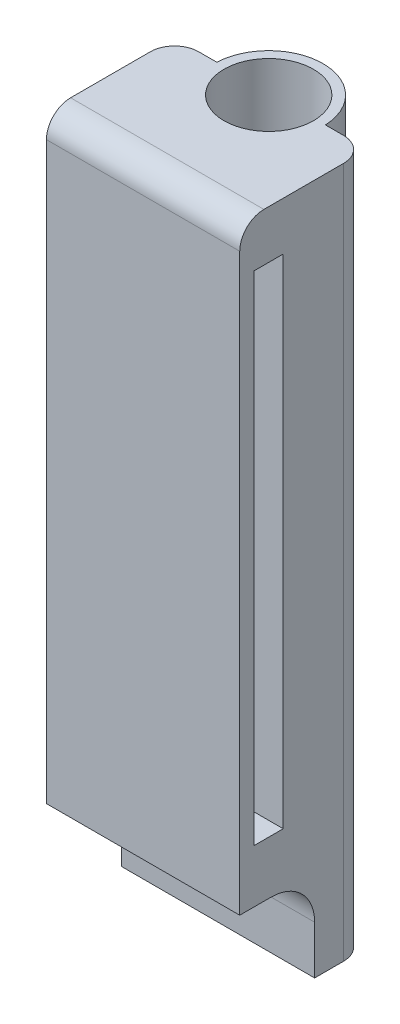
ISO-10303-21;
HEADER;
FILE_DESCRIPTION(('STEP AP214'),'2;1');
FILE_NAME('part.step','',(''),(''),'','','');
FILE_SCHEMA(('AUTOMOTIVE_DESIGN { 1 0 10303 214 1 1 1 1 }'));
ENDSEC;
DATA;
#1=APPLICATION_CONTEXT('core data for automotive mechanical design processes');
#2=APPLICATION_PROTOCOL_DEFINITION('international standard','automotive_design',2000,#1);
#3=PRODUCT_CONTEXT('',#1,'mechanical');
#4=PRODUCT('Part','Part','',(#3));
#5=PRODUCT_RELATED_PRODUCT_CATEGORY('part','',(#4));
#6=PRODUCT_DEFINITION_FORMATION('','',#4);
#7=PRODUCT_DEFINITION_CONTEXT('part definition',#1,'design');
#8=PRODUCT_DEFINITION('design','',#6,#7);
#9=PRODUCT_DEFINITION_SHAPE('','',#8);
#10=(LENGTH_UNIT() NAMED_UNIT(*) SI_UNIT(.MILLI.,.METRE.));
#11=(NAMED_UNIT(*) PLANE_ANGLE_UNIT() SI_UNIT($,.RADIAN.));
#12=(NAMED_UNIT(*) SI_UNIT($,.STERADIAN.) SOLID_ANGLE_UNIT());
#13=UNCERTAINTY_MEASURE_WITH_UNIT(LENGTH_MEASURE(1.E-05),#10,'distance_accuracy_value','');
#14=(GEOMETRIC_REPRESENTATION_CONTEXT(3) GLOBAL_UNCERTAINTY_ASSIGNED_CONTEXT((#13)) GLOBAL_UNIT_ASSIGNED_CONTEXT((#10,
#11,#12)) REPRESENTATION_CONTEXT('',''));
#15=CARTESIAN_POINT('',(0.,0.,0.));
#16=DIRECTION('',(0.,0.,1.));
#17=DIRECTION('',(1.,0.,0.));
#18=AXIS2_PLACEMENT_3D('',#15,#16,#17);
#19=CARTESIAN_POINT('',(0.,143.,0.));
#20=DIRECTION('',(0.,1.,0.));
#21=DIRECTION('',(0.,0.,1.));
#22=AXIS2_PLACEMENT_3D('',#19,#20,#21);
#23=PLANE('',#22);
#24=DIRECTION('',(0.,0.,1.));
#25=VECTOR('',#24,1.);
#26=CARTESIAN_POINT('',(-20.,143.,-0.499999999999993));
#27=LINE('',#26,#25);
#28=CARTESIAN_POINT('',(-20.,143.,4.50000000000001));
#29=VERTEX_POINT('',#28);
#30=CARTESIAN_POINT('',(-20.,143.,21.));
#31=VERTEX_POINT('',#30);
#32=EDGE_CURVE('E188',#29,#31,#27,.T.);
#33=ORIENTED_EDGE('',*,*,#32,.T.);
#34=DIRECTION('',(1.,0.,0.));
#35=VECTOR('',#34,1.);
#36=CARTESIAN_POINT('',(20.,143.,21.));
#37=LINE('',#36,#35);
#38=CARTESIAN_POINT('',(20.,143.,21.));
#39=VERTEX_POINT('',#38);
#40=EDGE_CURVE('E232',#31,#39,#37,.T.);
#41=ORIENTED_EDGE('',*,*,#40,.T.);
#42=DIRECTION('',(0.,0.,-1.));
#43=VECTOR('',#42,1.);
#44=CARTESIAN_POINT('',(20.,143.,26.));
#45=LINE('',#44,#43);
#46=CARTESIAN_POINT('',(20.,143.,4.50000000000001));
#47=VERTEX_POINT('',#46);
#48=EDGE_CURVE('E198',#39,#47,#45,.T.);
#49=ORIENTED_EDGE('',*,*,#48,.T.);
#50=CARTESIAN_POINT('',(15.,143.,4.50000000000001));
#51=DIRECTION('',(0.,1.,0.));
#52=DIRECTION('',(0.,0.,1.));
#53=AXIS2_PLACEMENT_3D('',#50,#51,#52);
#54=CIRCLE('',#53,5.);
#55=CARTESIAN_POINT('',(15.,143.,-0.499999999999993));
#56=VERTEX_POINT('',#55);
#57=EDGE_CURVE('E218',#47,#56,#54,.T.);
#58=ORIENTED_EDGE('',*,*,#57,.T.);
#59=DIRECTION('',(-1.,0.,0.));
#60=VECTOR('',#59,1.);
#61=CARTESIAN_POINT('',(20.,143.,-0.499999999999993));
#62=LINE('',#61,#60);
#63=CARTESIAN_POINT('',(11.2388833964945,143.,-0.499999999999992));
#64=VERTEX_POINT('',#63);
#65=EDGE_CURVE('E252',#56,#64,#62,.T.);
#66=ORIENTED_EDGE('',*,*,#65,.T.);
#67=CARTESIAN_POINT('',(0.,143.,0.));
#68=DIRECTION('',(0.,1.,0.));
#69=DIRECTION('',(0.,0.,1.));
#70=AXIS2_PLACEMENT_3D('',#67,#68,#69);
#71=CIRCLE('',#70,11.25);
#72=CARTESIAN_POINT('',(-11.2388833964945,143.,-0.499999999999993));
#73=VERTEX_POINT('',#72);
#74=EDGE_CURVE('E251',#64,#73,#71,.T.);
#75=ORIENTED_EDGE('',*,*,#74,.T.);
#76=DIRECTION('',(-1.,0.,0.));
#77=VECTOR('',#76,1.);
#78=CARTESIAN_POINT('',(-17.,143.,-0.499999999999993));
#79=LINE('',#78,#77);
#80=CARTESIAN_POINT('',(-15.,143.,-0.499999999999993));
#81=VERTEX_POINT('',#80);
#82=EDGE_CURVE('E250',#73,#81,#79,.T.);
#83=ORIENTED_EDGE('',*,*,#82,.T.);
#84=CARTESIAN_POINT('',(-15.,143.,4.50000000000001));
#85=DIRECTION('',(0.,1.,0.));
#86=DIRECTION('',(0.,0.,1.));
#87=AXIS2_PLACEMENT_3D('',#84,#85,#86);
#88=CIRCLE('',#87,5.);
#89=EDGE_CURVE('E220',#81,#29,#88,.T.);
#90=ORIENTED_EDGE('',*,*,#89,.T.);
#91=EDGE_LOOP('',(#33,#41,#49,#58,#66,#75,#83,#90));
#92=FACE_BOUND('',#91,.T.);
#93=CARTESIAN_POINT('',(0.,143.,0.));
#94=DIRECTION('',(0.,1.,0.));
#95=DIRECTION('',(0.,0.,1.));
#96=AXIS2_PLACEMENT_3D('',#93,#94,#95);
#97=CIRCLE('',#96,9.25);
#98=CARTESIAN_POINT('',(0.,143.,9.25));
#99=VERTEX_POINT('',#98);
#100=EDGE_CURVE('E180',#99,#99,#97,.T.);
#101=ORIENTED_EDGE('',*,*,#100,.F.);
#102=EDGE_LOOP('',(#101));
#103=FACE_BOUND('',#102,.T.);
#104=ADVANCED_FACE('F37',(#92,#103),#23,.T.);
#105=CARTESIAN_POINT('',(0.,0.,0.));
#106=DIRECTION('',(0.,1.,0.));
#107=DIRECTION('',(0.,0.,1.));
#108=AXIS2_PLACEMENT_3D('',#105,#106,#107);
#109=PLANE('',#108);
#110=DIRECTION('',(0.,0.,-1.));
#111=VECTOR('',#110,1.);
#112=CARTESIAN_POINT('',(20.,0.,2.50000000000003));
#113=LINE('',#112,#111);
#114=CARTESIAN_POINT('',(20.,0.,10.5));
#115=VERTEX_POINT('',#114);
#116=CARTESIAN_POINT('',(20.,0.,4.50000000000001));
#117=VERTEX_POINT('',#116);
#118=EDGE_CURVE('E169',#115,#117,#113,.T.);
#119=ORIENTED_EDGE('',*,*,#118,.F.);
#120=DIRECTION('',(1.,0.,0.));
#121=VECTOR('',#120,1.);
#122=CARTESIAN_POINT('',(-33.,0.,10.5));
#123=LINE('',#122,#121);
#124=CARTESIAN_POINT('',(-20.,0.,10.5));
#125=VERTEX_POINT('',#124);
#126=EDGE_CURVE('E152',#125,#115,#123,.T.);
#127=ORIENTED_EDGE('',*,*,#126,.F.);
#128=DIRECTION('',(0.,0.,1.));
#129=VECTOR('',#128,1.);
#130=CARTESIAN_POINT('',(-20.,0.,26.));
#131=LINE('',#130,#129);
#132=CARTESIAN_POINT('',(-20.,0.,4.50000000000001));
#133=VERTEX_POINT('',#132);
#134=EDGE_CURVE('E196',#133,#125,#131,.T.);
#135=ORIENTED_EDGE('',*,*,#134,.F.);
#136=CARTESIAN_POINT('',(-15.,0.,4.50000000000001));
#137=DIRECTION('',(0.,1.,0.));
#138=DIRECTION('',(0.,0.,1.));
#139=AXIS2_PLACEMENT_3D('',#136,#137,#138);
#140=CIRCLE('',#139,5.);
#141=CARTESIAN_POINT('',(-15.,0.,-0.499999999999993));
#142=VERTEX_POINT('',#141);
#143=EDGE_CURVE('E214',#133,#142,#140,.F.);
#144=ORIENTED_EDGE('',*,*,#143,.T.);
#145=DIRECTION('',(-1.,0.,0.));
#146=VECTOR('',#145,1.);
#147=CARTESIAN_POINT('',(-17.,0.,-0.499999999999993));
#148=LINE('',#147,#146);
#149=CARTESIAN_POINT('',(-11.2388833964945,0.,-0.499999999999993));
#150=VERTEX_POINT('',#149);
#151=EDGE_CURVE('E193',#150,#142,#148,.T.);
#152=ORIENTED_EDGE('',*,*,#151,.F.);
#153=CARTESIAN_POINT('',(0.,0.,0.));
#154=DIRECTION('',(0.,1.,0.));
#155=DIRECTION('',(0.,0.,1.));
#156=AXIS2_PLACEMENT_3D('',#153,#154,#155);
#157=CIRCLE('',#156,11.25);
#158=CARTESIAN_POINT('',(11.2388833964945,0.,-0.499999999999992));
#159=VERTEX_POINT('',#158);
#160=EDGE_CURVE('E182',#159,#150,#157,.T.);
#161=ORIENTED_EDGE('',*,*,#160,.F.);
#162=DIRECTION('',(-1.,0.,0.));
#163=VECTOR('',#162,1.);
#164=CARTESIAN_POINT('',(17.,0.,-0.499999999999993));
#165=LINE('',#164,#163);
#166=CARTESIAN_POINT('',(15.,0.,-0.499999999999993));
#167=VERTEX_POINT('',#166);
#168=EDGE_CURVE('E179',#167,#159,#165,.T.);
#169=ORIENTED_EDGE('',*,*,#168,.F.);
#170=CARTESIAN_POINT('',(15.,0.,4.50000000000001));
#171=DIRECTION('',(0.,1.,0.));
#172=DIRECTION('',(0.,0.,1.));
#173=AXIS2_PLACEMENT_3D('',#170,#171,#172);
#174=CIRCLE('',#173,5.);
#175=EDGE_CURVE('E177',#167,#117,#174,.F.);
#176=ORIENTED_EDGE('',*,*,#175,.T.);
#177=EDGE_LOOP('',(#119,#127,#135,#144,#152,#161,#169,#176));
#178=FACE_BOUND('',#177,.T.);
#179=CARTESIAN_POINT('',(0.,0.,0.));
#180=DIRECTION('',(0.,1.,0.));
#181=DIRECTION('',(0.,0.,1.));
#182=AXIS2_PLACEMENT_3D('',#179,#180,#181);
#183=CIRCLE('',#182,9.25);
#184=CARTESIAN_POINT('',(0.,0.,9.25));
#185=VERTEX_POINT('',#184);
#186=EDGE_CURVE('E185',#185,#185,#183,.T.);
#187=ORIENTED_EDGE('',*,*,#186,.T.);
#188=EDGE_LOOP('',(#187));
#189=FACE_BOUND('',#188,.T.);
#190=ADVANCED_FACE('F174',(#178,#189),#109,.F.);
#191=CARTESIAN_POINT('',(20.,143.,2.50000000000003));
#192=DIRECTION('',(-1.,0.,0.));
#193=DIRECTION('',(0.,0.,1.));
#194=AXIS2_PLACEMENT_3D('',#191,#192,#193);
#195=PLANE('',#194);
#196=DIRECTION('',(0.,0.,-1.));
#197=VECTOR('',#196,1.);
#198=CARTESIAN_POINT('',(20.,30.,23.));
#199=LINE('',#198,#197);
#200=CARTESIAN_POINT('',(20.,30.,23.));
#201=VERTEX_POINT('',#200);
#202=CARTESIAN_POINT('',(20.,30.,17.));
#203=VERTEX_POINT('',#202);
#204=EDGE_CURVE('E278',#201,#203,#199,.T.);
#205=ORIENTED_EDGE('',*,*,#204,.F.);
#206=DIRECTION('',(0.,-1.,0.));
#207=VECTOR('',#206,1.);
#208=CARTESIAN_POINT('',(20.,133.,23.));
#209=LINE('',#208,#207);
#210=CARTESIAN_POINT('',(20.,133.,23.));
#211=VERTEX_POINT('',#210);
#212=EDGE_CURVE('E281',#211,#201,#209,.T.);
#213=ORIENTED_EDGE('',*,*,#212,.F.);
#214=DIRECTION('',(0.,0.,1.));
#215=VECTOR('',#214,1.);
#216=CARTESIAN_POINT('',(20.,133.,23.));
#217=LINE('',#216,#215);
#218=CARTESIAN_POINT('',(20.,133.,17.));
#219=VERTEX_POINT('',#218);
#220=EDGE_CURVE('E266',#219,#211,#217,.T.);
#221=ORIENTED_EDGE('',*,*,#220,.F.);
#222=DIRECTION('',(0.,1.,0.));
#223=VECTOR('',#222,1.);
#224=CARTESIAN_POINT('',(20.,133.,17.));
#225=LINE('',#224,#223);
#226=EDGE_CURVE('E275',#203,#219,#225,.T.);
#227=ORIENTED_EDGE('',*,*,#226,.F.);
#228=EDGE_LOOP('',(#205,#213,#221,#227));
#229=FACE_BOUND('',#228,.T.);
#230=DIRECTION('',(0.,-1.,0.));
#231=VECTOR('',#230,1.);
#232=CARTESIAN_POINT('',(20.,143.,26.));
#233=LINE('',#232,#231);
#234=CARTESIAN_POINT('',(20.,138.,26.));
#235=VERTEX_POINT('',#234);
#236=CARTESIAN_POINT('',(20.,19.,26.));
#237=VERTEX_POINT('',#236);
#238=EDGE_CURVE('E208',#235,#237,#233,.T.);
#239=ORIENTED_EDGE('',*,*,#238,.T.);
#240=DIRECTION('',(0.,0.,1.));
#241=VECTOR('',#240,1.);
#242=CARTESIAN_POINT('',(20.,19.,19.5));
#243=LINE('',#242,#241);
#244=CARTESIAN_POINT('',(20.,19.,19.5));
#245=VERTEX_POINT('',#244);
#246=EDGE_CURVE('E52',#245,#237,#243,.T.);
#247=ORIENTED_EDGE('',*,*,#246,.F.);
#248=CARTESIAN_POINT('',(20.,10.,19.5));
#249=DIRECTION('',(1.,0.,0.));
#250=DIRECTION('',(0.,0.,-1.));
#251=AXIS2_PLACEMENT_3D('',#248,#249,#250);
#252=CIRCLE('',#251,9.);
#253=CARTESIAN_POINT('',(20.,10.,10.5));
#254=VERTEX_POINT('',#253);
#255=EDGE_CURVE('E172',#254,#245,#252,.T.);
#256=ORIENTED_EDGE('',*,*,#255,.F.);
#257=DIRECTION('',(0.,1.,0.));
#258=VECTOR('',#257,1.);
#259=CARTESIAN_POINT('',(20.,0.,10.5));
#260=LINE('',#259,#258);
#261=EDGE_CURVE('E156',#115,#254,#260,.T.);
#262=ORIENTED_EDGE('',*,*,#261,.F.);
#263=ORIENTED_EDGE('',*,*,#118,.T.);
#264=DIRECTION('',(0.,-1.,0.));
#265=VECTOR('',#264,1.);
#266=CARTESIAN_POINT('',(20.,143.,4.50000000000001));
#267=LINE('',#266,#265);
#268=EDGE_CURVE('E225',#117,#47,#267,.F.);
#269=ORIENTED_EDGE('',*,*,#268,.T.);
#270=ORIENTED_EDGE('',*,*,#48,.F.);
#271=CARTESIAN_POINT('',(20.,138.,21.));
#272=DIRECTION('',(-1.,0.,0.));
#273=DIRECTION('',(0.,0.,1.));
#274=AXIS2_PLACEMENT_3D('',#271,#272,#273);
#275=CIRCLE('',#274,5.);
#276=EDGE_CURVE('E229',#39,#235,#275,.F.);
#277=ORIENTED_EDGE('',*,*,#276,.T.);
#278=EDGE_LOOP('',(#239,#247,#256,#262,#263,#269,#270,#277));
#279=FACE_BOUND('',#278,.T.);
#280=ADVANCED_FACE('F167',(#229,#279),#195,.F.);
#281=CARTESIAN_POINT('',(17.,143.,-0.499999999999993));
#282=DIRECTION('',(0.,0.,1.));
#283=DIRECTION('',(1.,0.,0.));
#284=AXIS2_PLACEMENT_3D('',#281,#282,#283);
#285=PLANE('',#284);
#286=ORIENTED_EDGE('',*,*,#65,.F.);
#287=DIRECTION('',(0.,-1.,0.));
#288=VECTOR('',#287,1.);
#289=CARTESIAN_POINT('',(15.,143.,-0.499999999999993));
#290=LINE('',#289,#288);
#291=EDGE_CURVE('E222',#56,#167,#290,.T.);
#292=ORIENTED_EDGE('',*,*,#291,.T.);
#293=ORIENTED_EDGE('',*,*,#168,.T.);
#294=DIRECTION('',(0.,-1.,0.));
#295=VECTOR('',#294,1.);
#296=CARTESIAN_POINT('',(11.2388833964945,143.,-0.499999999999992));
#297=LINE('',#296,#295);
#298=EDGE_CURVE('E205',#64,#159,#297,.T.);
#299=ORIENTED_EDGE('',*,*,#298,.F.);
#300=EDGE_LOOP('',(#286,#292,#293,#299));
#301=FACE_BOUND('',#300,.T.);
#302=ADVANCED_FACE('F311',(#301),#285,.F.);
#303=CARTESIAN_POINT('',(0.,143.,0.));
#304=DIRECTION('',(0.,-1.,0.));
#305=DIRECTION('',(0.,0.,-1.));
#306=AXIS2_PLACEMENT_3D('',#303,#304,#305);
#307=CYLINDRICAL_SURFACE('',#306,11.25);
#308=ORIENTED_EDGE('',*,*,#160,.T.);
#309=DIRECTION('',(0.,-1.,0.));
#310=VECTOR('',#309,1.);
#311=CARTESIAN_POINT('',(-11.2388833964945,143.,-0.499999999999993));
#312=LINE('',#311,#310);
#313=EDGE_CURVE('E202',#73,#150,#312,.T.);
#314=ORIENTED_EDGE('',*,*,#313,.F.);
#315=ORIENTED_EDGE('',*,*,#74,.F.);
#316=ORIENTED_EDGE('',*,*,#298,.T.);
#317=EDGE_LOOP('',(#308,#314,#315,#316));
#318=FACE_BOUND('',#317,.T.);
#319=ADVANCED_FACE('F314',(#318),#307,.T.);
#320=CARTESIAN_POINT('',(-17.,143.,-0.499999999999993));
#321=DIRECTION('',(0.,0.,1.));
#322=DIRECTION('',(1.,0.,0.));
#323=AXIS2_PLACEMENT_3D('',#320,#321,#322);
#324=PLANE('',#323);
#325=ORIENTED_EDGE('',*,*,#151,.T.);
#326=DIRECTION('',(0.,-1.,0.));
#327=VECTOR('',#326,1.);
#328=CARTESIAN_POINT('',(-15.,143.,-0.499999999999993));
#329=LINE('',#328,#327);
#330=EDGE_CURVE('E216',#142,#81,#329,.F.);
#331=ORIENTED_EDGE('',*,*,#330,.T.);
#332=ORIENTED_EDGE('',*,*,#82,.F.);
#333=ORIENTED_EDGE('',*,*,#313,.T.);
#334=EDGE_LOOP('',(#325,#331,#332,#333));
#335=FACE_BOUND('',#334,.T.);
#336=ADVANCED_FACE('F241',(#335),#324,.F.);
#337=CARTESIAN_POINT('',(-20.,143.,26.));
#338=DIRECTION('',(1.,0.,0.));
#339=DIRECTION('',(0.,0.,-1.));
#340=AXIS2_PLACEMENT_3D('',#337,#338,#339);
#341=PLANE('',#340);
#342=CARTESIAN_POINT('',(-20.,10.,19.5));
#343=DIRECTION('',(1.,0.,0.));
#344=DIRECTION('',(0.,0.,-1.));
#345=AXIS2_PLACEMENT_3D('',#342,#343,#344);
#346=CIRCLE('',#345,9.);
#347=CARTESIAN_POINT('',(-20.,10.,10.5));
#348=VERTEX_POINT('',#347);
#349=CARTESIAN_POINT('',(-20.,19.,19.5));
#350=VERTEX_POINT('',#349);
#351=EDGE_CURVE('E12',#348,#350,#346,.T.);
#352=ORIENTED_EDGE('',*,*,#351,.T.);
#353=DIRECTION('',(0.,0.,1.));
#354=VECTOR('',#353,1.);
#355=CARTESIAN_POINT('',(-20.,19.,26.0000000000001));
#356=LINE('',#355,#354);
#357=CARTESIAN_POINT('',(-20.,19.,26.));
#358=VERTEX_POINT('',#357);
#359=EDGE_CURVE('E283',#350,#358,#356,.T.);
#360=ORIENTED_EDGE('',*,*,#359,.T.);
#361=DIRECTION('',(0.,-1.,0.));
#362=VECTOR('',#361,1.);
#363=CARTESIAN_POINT('',(-20.,143.,26.));
#364=LINE('',#363,#362);
#365=CARTESIAN_POINT('',(-20.,138.,26.));
#366=VERTEX_POINT('',#365);
#367=EDGE_CURVE('E199',#366,#358,#364,.T.);
#368=ORIENTED_EDGE('',*,*,#367,.F.);
#369=CARTESIAN_POINT('',(-20.,138.,21.));
#370=DIRECTION('',(1.,0.,0.));
#371=DIRECTION('',(0.,0.,-1.));
#372=AXIS2_PLACEMENT_3D('',#369,#370,#371);
#373=CIRCLE('',#372,5.);
#374=EDGE_CURVE('E60',#366,#31,#373,.F.);
#375=ORIENTED_EDGE('',*,*,#374,.T.);
#376=ORIENTED_EDGE('',*,*,#32,.F.);
#377=DIRECTION('',(0.,-1.,0.));
#378=VECTOR('',#377,1.);
#379=CARTESIAN_POINT('',(-20.,143.,4.50000000000001));
#380=LINE('',#379,#378);
#381=EDGE_CURVE('E210',#29,#133,#380,.T.);
#382=ORIENTED_EDGE('',*,*,#381,.T.);
#383=ORIENTED_EDGE('',*,*,#134,.T.);
#384=DIRECTION('',(0.,1.,0.));
#385=VECTOR('',#384,1.);
#386=CARTESIAN_POINT('',(-20.,143.,10.5));
#387=LINE('',#386,#385);
#388=EDGE_CURVE('E45',#125,#348,#387,.T.);
#389=ORIENTED_EDGE('',*,*,#388,.T.);
#390=EDGE_LOOP('',(#352,#360,#368,#375,#376,#382,#383,#389));
#391=FACE_BOUND('',#390,.T.);
#392=ADVANCED_FACE('F234',(#391),#341,.F.);
#393=CARTESIAN_POINT('',(0.,143.,26.));
#394=DIRECTION('',(0.,0.,-1.));
#395=DIRECTION('',(-1.,0.,0.));
#396=AXIS2_PLACEMENT_3D('',#393,#394,#395);
#397=PLANE('',#396);
#398=ORIENTED_EDGE('',*,*,#367,.T.);
#399=DIRECTION('',(1.,0.,0.));
#400=VECTOR('',#399,1.);
#401=CARTESIAN_POINT('',(-33.,19.,26.));
#402=LINE('',#401,#400);
#403=EDGE_CURVE('E288',#358,#237,#402,.T.);
#404=ORIENTED_EDGE('',*,*,#403,.T.);
#405=ORIENTED_EDGE('',*,*,#238,.F.);
#406=DIRECTION('',(1.,0.,0.));
#407=VECTOR('',#406,1.);
#408=CARTESIAN_POINT('',(-20.,138.,26.));
#409=LINE('',#408,#407);
#410=EDGE_CURVE('E227',#235,#366,#409,.F.);
#411=ORIENTED_EDGE('',*,*,#410,.T.);
#412=EDGE_LOOP('',(#398,#404,#405,#411));
#413=FACE_BOUND('',#412,.T.);
#414=ADVANCED_FACE('F302',(#413),#397,.F.);
#415=CARTESIAN_POINT('',(0.,143.,0.));
#416=DIRECTION('',(0.,-1.,0.));
#417=DIRECTION('',(0.,0.,-1.));
#418=AXIS2_PLACEMENT_3D('',#415,#416,#417);
#419=CYLINDRICAL_SURFACE('',#418,9.25);
#420=ORIENTED_EDGE('',*,*,#100,.T.);
#421=EDGE_LOOP('',(#420));
#422=FACE_BOUND('',#421,.T.);
#423=ORIENTED_EDGE('',*,*,#186,.F.);
#424=EDGE_LOOP('',(#423));
#425=FACE_BOUND('',#424,.T.);
#426=ADVANCED_FACE('F330',(#422,#425),#419,.F.);
#427=CARTESIAN_POINT('',(-15.,143.,4.50000000000001));
#428=DIRECTION('',(0.,-1.,0.));
#429=DIRECTION('',(0.,0.,-1.));
#430=AXIS2_PLACEMENT_3D('',#427,#428,#429);
#431=CYLINDRICAL_SURFACE('',#430,5.);
#432=ORIENTED_EDGE('',*,*,#89,.F.);
#433=ORIENTED_EDGE('',*,*,#330,.F.);
#434=ORIENTED_EDGE('',*,*,#143,.F.);
#435=ORIENTED_EDGE('',*,*,#381,.F.);
#436=EDGE_LOOP('',(#432,#433,#434,#435));
#437=FACE_BOUND('',#436,.T.);
#438=ADVANCED_FACE('F246',(#437),#431,.T.);
#439=CARTESIAN_POINT('',(15.,143.,4.50000000000001));
#440=DIRECTION('',(0.,-1.,0.));
#441=DIRECTION('',(0.,0.,-1.));
#442=AXIS2_PLACEMENT_3D('',#439,#440,#441);
#443=CYLINDRICAL_SURFACE('',#442,5.);
#444=ORIENTED_EDGE('',*,*,#57,.F.);
#445=ORIENTED_EDGE('',*,*,#268,.F.);
#446=ORIENTED_EDGE('',*,*,#175,.F.);
#447=ORIENTED_EDGE('',*,*,#291,.F.);
#448=EDGE_LOOP('',(#444,#445,#446,#447));
#449=FACE_BOUND('',#448,.T.);
#450=ADVANCED_FACE('F307',(#449),#443,.T.);
#451=CARTESIAN_POINT('',(-123.174609279609,133.,23.));
#452=DIRECTION('',(0.,0.,1.));
#453=DIRECTION('',(0.,-1.,0.));
#454=AXIS2_PLACEMENT_3D('',#451,#452,#453);
#455=PLANE('',#454);
#456=DIRECTION('',(0.,1.,0.));
#457=VECTOR('',#456,1.);
#458=CARTESIAN_POINT('',(-17.,133.,23.));
#459=LINE('',#458,#457);
#460=CARTESIAN_POINT('',(-17.,30.,23.));
#461=VERTEX_POINT('',#460);
#462=CARTESIAN_POINT('',(-17.,133.,23.));
#463=VERTEX_POINT('',#462);
#464=EDGE_CURVE('E261',#461,#463,#459,.T.);
#465=ORIENTED_EDGE('',*,*,#464,.T.);
#466=DIRECTION('',(1.,0.,0.));
#467=VECTOR('',#466,1.);
#468=CARTESIAN_POINT('',(-123.174609279609,133.,23.));
#469=LINE('',#468,#467);
#470=EDGE_CURVE('E270',#463,#211,#469,.T.);
#471=ORIENTED_EDGE('',*,*,#470,.T.);
#472=ORIENTED_EDGE('',*,*,#212,.T.);
#473=DIRECTION('',(1.,0.,0.));
#474=VECTOR('',#473,1.);
#475=CARTESIAN_POINT('',(-123.174609279609,30.,23.));
#476=LINE('',#475,#474);
#477=EDGE_CURVE('E262',#461,#201,#476,.T.);
#478=ORIENTED_EDGE('',*,*,#477,.F.);
#479=EDGE_LOOP('',(#465,#471,#472,#478));
#480=FACE_BOUND('',#479,.T.);
#481=ADVANCED_FACE('F365',(#480),#455,.F.);
#482=CARTESIAN_POINT('',(-123.174609279609,133.,23.));
#483=DIRECTION('',(0.,1.,0.));
#484=DIRECTION('',(0.,0.,1.));
#485=AXIS2_PLACEMENT_3D('',#482,#483,#484);
#486=PLANE('',#485);
#487=DIRECTION('',(0.,0.,-1.));
#488=VECTOR('',#487,1.);
#489=CARTESIAN_POINT('',(-17.,133.,23.));
#490=LINE('',#489,#488);
#491=CARTESIAN_POINT('',(-17.,133.,17.));
#492=VERTEX_POINT('',#491);
#493=EDGE_CURVE('E285',#463,#492,#490,.T.);
#494=ORIENTED_EDGE('',*,*,#493,.T.);
#495=DIRECTION('',(1.,0.,0.));
#496=VECTOR('',#495,1.);
#497=CARTESIAN_POINT('',(-123.174609279609,133.,17.));
#498=LINE('',#497,#496);
#499=EDGE_CURVE('E268',#492,#219,#498,.T.);
#500=ORIENTED_EDGE('',*,*,#499,.T.);
#501=ORIENTED_EDGE('',*,*,#220,.T.);
#502=ORIENTED_EDGE('',*,*,#470,.F.);
#503=EDGE_LOOP('',(#494,#500,#501,#502));
#504=FACE_BOUND('',#503,.T.);
#505=ADVANCED_FACE('F371',(#504),#486,.F.);
#506=CARTESIAN_POINT('',(-123.174609279609,133.,17.));
#507=DIRECTION('',(0.,0.,-1.));
#508=DIRECTION('',(0.,1.,0.));
#509=AXIS2_PLACEMENT_3D('',#506,#507,#508);
#510=PLANE('',#509);
#511=DIRECTION('',(0.,-1.,0.));
#512=VECTOR('',#511,1.);
#513=CARTESIAN_POINT('',(-17.,133.,17.));
#514=LINE('',#513,#512);
#515=CARTESIAN_POINT('',(-17.,30.,17.));
#516=VERTEX_POINT('',#515);
#517=EDGE_CURVE('E272',#492,#516,#514,.T.);
#518=ORIENTED_EDGE('',*,*,#517,.T.);
#519=DIRECTION('',(1.,0.,0.));
#520=VECTOR('',#519,1.);
#521=CARTESIAN_POINT('',(-123.174609279609,30.,17.));
#522=LINE('',#521,#520);
#523=EDGE_CURVE('E265',#516,#203,#522,.T.);
#524=ORIENTED_EDGE('',*,*,#523,.T.);
#525=ORIENTED_EDGE('',*,*,#226,.T.);
#526=ORIENTED_EDGE('',*,*,#499,.F.);
#527=EDGE_LOOP('',(#518,#524,#525,#526));
#528=FACE_BOUND('',#527,.T.);
#529=ADVANCED_FACE('F378',(#528),#510,.F.);
#530=CARTESIAN_POINT('',(-123.174609279609,30.,23.));
#531=DIRECTION('',(0.,-1.,0.));
#532=DIRECTION('',(0.,0.,-1.));
#533=AXIS2_PLACEMENT_3D('',#530,#531,#532);
#534=PLANE('',#533);
#535=DIRECTION('',(0.,0.,1.));
#536=VECTOR('',#535,1.);
#537=CARTESIAN_POINT('',(-17.,30.,23.));
#538=LINE('',#537,#536);
#539=EDGE_CURVE('E258',#516,#461,#538,.T.);
#540=ORIENTED_EDGE('',*,*,#539,.T.);
#541=ORIENTED_EDGE('',*,*,#477,.T.);
#542=ORIENTED_EDGE('',*,*,#204,.T.);
#543=ORIENTED_EDGE('',*,*,#523,.F.);
#544=EDGE_LOOP('',(#540,#541,#542,#543));
#545=FACE_BOUND('',#544,.T.);
#546=ADVANCED_FACE('F386',(#545),#534,.F.);
#547=CARTESIAN_POINT('',(-17.,143.,26.));
#548=DIRECTION('',(1.,0.,0.));
#549=DIRECTION('',(0.,0.,-1.));
#550=AXIS2_PLACEMENT_3D('',#547,#548,#549);
#551=PLANE('',#550);
#552=ORIENTED_EDGE('',*,*,#464,.F.);
#553=ORIENTED_EDGE('',*,*,#539,.F.);
#554=ORIENTED_EDGE('',*,*,#517,.F.);
#555=ORIENTED_EDGE('',*,*,#493,.F.);
#556=EDGE_LOOP('',(#552,#553,#554,#555));
#557=FACE_BOUND('',#556,.T.);
#558=ADVANCED_FACE('F394',(#557),#551,.T.);
#559=CARTESIAN_POINT('',(0.,138.,21.));
#560=DIRECTION('',(-1.,0.,0.));
#561=DIRECTION('',(0.,0.,1.));
#562=AXIS2_PLACEMENT_3D('',#559,#560,#561);
#563=CYLINDRICAL_SURFACE('',#562,5.);
#564=ORIENTED_EDGE('',*,*,#374,.F.);
#565=ORIENTED_EDGE('',*,*,#410,.F.);
#566=ORIENTED_EDGE('',*,*,#276,.F.);
#567=ORIENTED_EDGE('',*,*,#40,.F.);
#568=EDGE_LOOP('',(#564,#565,#566,#567));
#569=FACE_BOUND('',#568,.T.);
#570=ADVANCED_FACE('F39',(#569),#563,.T.);
#571=CARTESIAN_POINT('',(-33.,10.,19.5));
#572=DIRECTION('',(1.,0.,0.));
#573=DIRECTION('',(0.,0.,-1.));
#574=AXIS2_PLACEMENT_3D('',#571,#572,#573);
#575=CYLINDRICAL_SURFACE('',#574,9.);
#576=DIRECTION('',(1.,0.,0.));
#577=VECTOR('',#576,1.);
#578=CARTESIAN_POINT('',(-33.,10.,10.5));
#579=LINE('',#578,#577);
#580=EDGE_CURVE('E163',#348,#254,#579,.T.);
#581=ORIENTED_EDGE('',*,*,#580,.T.);
#582=ORIENTED_EDGE('',*,*,#255,.T.);
#583=DIRECTION('',(1.,0.,0.));
#584=VECTOR('',#583,1.);
#585=CARTESIAN_POINT('',(-33.,19.,19.5));
#586=LINE('',#585,#584);
#587=EDGE_CURVE('E291',#350,#245,#586,.T.);
#588=ORIENTED_EDGE('',*,*,#587,.F.);
#589=ORIENTED_EDGE('',*,*,#351,.F.);
#590=EDGE_LOOP('',(#581,#582,#588,#589));
#591=FACE_BOUND('',#590,.T.);
#592=ADVANCED_FACE('F297',(#591),#575,.F.);
#593=CARTESIAN_POINT('',(-33.,0.,10.5));
#594=DIRECTION('',(0.,0.,-1.));
#595=DIRECTION('',(0.,1.,0.));
#596=AXIS2_PLACEMENT_3D('',#593,#594,#595);
#597=PLANE('',#596);
#598=ORIENTED_EDGE('',*,*,#126,.T.);
#599=ORIENTED_EDGE('',*,*,#261,.T.);
#600=ORIENTED_EDGE('',*,*,#580,.F.);
#601=ORIENTED_EDGE('',*,*,#388,.F.);
#602=EDGE_LOOP('',(#598,#599,#600,#601));
#603=FACE_BOUND('',#602,.T.);
#604=ADVANCED_FACE('F154',(#603),#597,.F.);
#605=CARTESIAN_POINT('',(-33.,19.,19.5));
#606=DIRECTION('',(0.,1.,0.));
#607=DIRECTION('',(0.,0.,1.));
#608=AXIS2_PLACEMENT_3D('',#605,#606,#607);
#609=PLANE('',#608);
#610=ORIENTED_EDGE('',*,*,#587,.T.);
#611=ORIENTED_EDGE('',*,*,#246,.T.);
#612=ORIENTED_EDGE('',*,*,#403,.F.);
#613=ORIENTED_EDGE('',*,*,#359,.F.);
#614=EDGE_LOOP('',(#610,#611,#612,#613));
#615=FACE_BOUND('',#614,.T.);
#616=ADVANCED_FACE('F420',(#615),#609,.F.);
#617=CLOSED_SHELL('',(#104,#190,#280,#302,#319,#336,#392,#414,#426,#438,#450,#481,#505,#529,
#546,#558,#570,#592,#604,#616));
#618=MANIFOLD_SOLID_BREP('B2',#617);
#619=ADVANCED_BREP_SHAPE_REPRESENTATION('',(#18,#618),#14);
#620=SHAPE_DEFINITION_REPRESENTATION(#9,#619);
ENDSEC;
END-ISO-10303-21;
